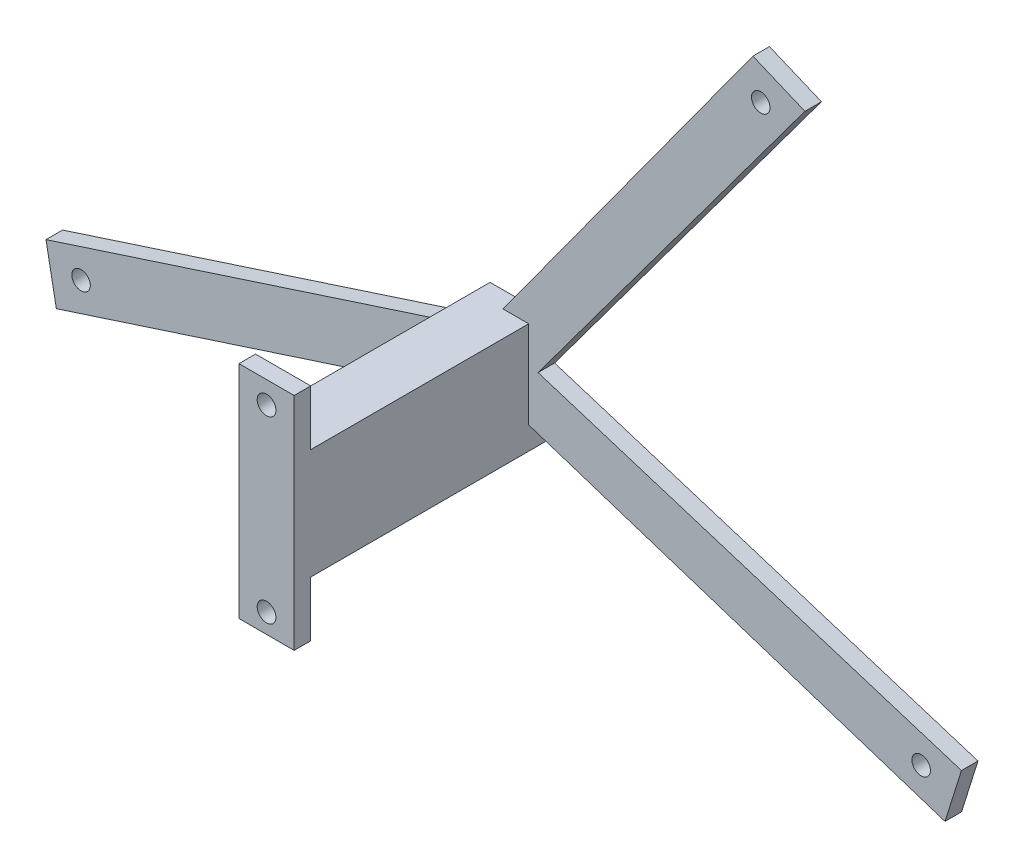
ISO-10303-21;
HEADER;
FILE_DESCRIPTION(('STEP AP214'),'2;1');
FILE_NAME('part.step','',(''),(''),'','','');
FILE_SCHEMA(('AUTOMOTIVE_DESIGN { 1 0 10303 214 1 1 1 1 }'));
ENDSEC;
DATA;
#1=APPLICATION_CONTEXT('core data for automotive mechanical design processes');
#2=APPLICATION_PROTOCOL_DEFINITION('international standard','automotive_design',2000,#1);
#3=PRODUCT_CONTEXT('',#1,'mechanical');
#4=PRODUCT('Part','Part','',(#3));
#5=PRODUCT_RELATED_PRODUCT_CATEGORY('part','',(#4));
#6=PRODUCT_DEFINITION_FORMATION('','',#4);
#7=PRODUCT_DEFINITION_CONTEXT('part definition',#1,'design');
#8=PRODUCT_DEFINITION('design','',#6,#7);
#9=PRODUCT_DEFINITION_SHAPE('','',#8);
#10=(LENGTH_UNIT() NAMED_UNIT(*) SI_UNIT(.MILLI.,.METRE.));
#11=(NAMED_UNIT(*) PLANE_ANGLE_UNIT() SI_UNIT($,.RADIAN.));
#12=(NAMED_UNIT(*) SI_UNIT($,.STERADIAN.) SOLID_ANGLE_UNIT());
#13=UNCERTAINTY_MEASURE_WITH_UNIT(LENGTH_MEASURE(1.E-05),#10,'distance_accuracy_value','');
#14=(GEOMETRIC_REPRESENTATION_CONTEXT(3) GLOBAL_UNCERTAINTY_ASSIGNED_CONTEXT((#13)) GLOBAL_UNIT_ASSIGNED_CONTEXT((#10,
#11,#12)) REPRESENTATION_CONTEXT('',''));
#15=CARTESIAN_POINT('',(0.,0.,0.));
#16=DIRECTION('',(0.,0.,1.));
#17=DIRECTION('',(1.,0.,0.));
#18=AXIS2_PLACEMENT_3D('',#15,#16,#17);
#19=CARTESIAN_POINT('',(0.,0.,8.));
#20=DIRECTION('',(0.,0.,-1.));
#21=DIRECTION('',(-1.,0.,0.));
#22=AXIS2_PLACEMENT_3D('',#19,#20,#21);
#23=PLANE('',#22);
#24=CARTESIAN_POINT('',(47.0395598085176,21.2443996673648,8.));
#25=DIRECTION('',(0.,0.,-1.));
#26=DIRECTION('',(-1.,0.,0.));
#27=AXIS2_PLACEMENT_3D('',#24,#25,#26);
#28=CIRCLE('',#27,1.675);
#29=CARTESIAN_POINT('',(45.3645598085176,21.2443996673648,8.));
#30=VERTEX_POINT('',#29);
#31=EDGE_CURVE('E285',#30,#30,#28,.T.);
#32=ORIENTED_EDGE('',*,*,#31,.T.);
#33=EDGE_LOOP('',(#32));
#34=FACE_BOUND('',#33,.T.);
#35=DIRECTION('',(-0.951056516295152,0.309016994374953,0.));
#36=VECTOR('',#35,1.);
#37=CARTESIAN_POINT('',(86.4547280678285,-76.8481551028898,8.));
#38=LINE('',#37,#36);
#39=CARTESIAN_POINT('',(80.4282405485893,-74.8900306087872,8.));
#40=VERTEX_POINT('',#39);
#41=CARTESIAN_POINT('',(5.,-50.3819096023564,8.));
#42=VERTEX_POINT('',#41);
#43=EDGE_CURVE('E223',#40,#42,#38,.T.);
#44=ORIENTED_EDGE('',*,*,#43,.F.);
#45=DIRECTION('',(0.299533418949089,0.954085808998682,0.));
#46=VECTOR('',#45,1.);
#47=CARTESIAN_POINT('',(94.6143138745912,-29.7039832781096,8.));
#48=LINE('',#47,#46);
#49=CARTESIAN_POINT('',(83.4045304167015,-65.4098332518603,8.));
#50=VERTEX_POINT('',#49);
#51=EDGE_CURVE('E70',#40,#50,#48,.T.);
#52=ORIENTED_EDGE('',*,*,#51,.T.);
#53=DIRECTION('',(0.954085808998682,-0.299533418949089,0.));
#54=VECTOR('',#53,1.);
#55=CARTESIAN_POINT('',(6.69130606358854,-41.3258628664165,8.));
#56=LINE('',#55,#54);
#57=CARTESIAN_POINT('',(6.69130606358854,-41.3258628664165,8.));
#58=VERTEX_POINT('',#57);
#59=EDGE_CURVE('E196',#58,#50,#56,.T.);
#60=ORIENTED_EDGE('',*,*,#59,.F.);
#61=DIRECTION('',(-0.595838024061852,-0.803104631465955,0.));
#62=VECTOR('',#61,1.);
#63=CARTESIAN_POINT('',(58.2556248583607,28.175480737277,8.));
#64=LINE('',#63,#62);
#65=CARTESIAN_POINT('',(55.0430430043356,23.8453788274612,8.));
#66=VERTEX_POINT('',#65);
#67=EDGE_CURVE('E222',#66,#58,#64,.T.);
#68=ORIENTED_EDGE('',*,*,#67,.F.);
#69=DIRECTION('',(-0.922272379336899,0.386540629575024,0.));
#70=VECTOR('',#69,1.);
#71=CARTESIAN_POINT('',(16.724958537207,39.9051642291254,8.));
#72=LINE('',#71,#70);
#73=CARTESIAN_POINT('',(45.6187140872192,27.7952813883114,8.));
#74=VERTEX_POINT('',#73);
#75=EDGE_CURVE('E200',#66,#74,#72,.T.);
#76=ORIENTED_EDGE('',*,*,#75,.T.);
#77=DIRECTION('',(0.587785252292486,0.809016994374938,0.));
#78=VECTOR('',#77,1.);
#79=CARTESIAN_POINT('',(-3.09016994375058,-39.2467459582402,8.));
#80=LINE('',#79,#78);
#81=CARTESIAN_POINT('',(0.348197207266024,-34.5142395756391,8.));
#82=VERTEX_POINT('',#81);
#83=EDGE_CURVE('E206',#82,#74,#80,.T.);
#84=ORIENTED_EDGE('',*,*,#83,.F.);
#85=DIRECTION('',(1.,0.,0.));
#86=VECTOR('',#85,1.);
#87=CARTESIAN_POINT('',(0.,-34.5142395756391,8.));
#88=LINE('',#87,#86);
#89=CARTESIAN_POINT('',(5.,-34.5142395756391,7.99999999999999));
#90=VERTEX_POINT('',#89);
#91=EDGE_CURVE('E263',#82,#90,#88,.T.);
#92=ORIENTED_EDGE('',*,*,#91,.T.);
#93=DIRECTION('',(0.,-1.,0.));
#94=VECTOR('',#93,1.);
#95=CARTESIAN_POINT('',(5.,0.,8.));
#96=LINE('',#95,#94);
#97=EDGE_CURVE('E261',#90,#42,#96,.T.);
#98=ORIENTED_EDGE('',*,*,#97,.T.);
#99=EDGE_LOOP('',(#44,#52,#60,#68,#76,#84,#92,#98));
#100=FACE_BOUND('',#99,.T.);
#101=CARTESIAN_POINT('',(76.1116065860137,-68.230160091727,8.));
#102=DIRECTION('',(0.,0.,-1.));
#103=DIRECTION('',(-1.,0.,0.));
#104=AXIS2_PLACEMENT_3D('',#101,#102,#103);
#105=CIRCLE('',#104,1.675);
#106=CARTESIAN_POINT('',(74.4366065860137,-68.230160091727,8.));
#107=VERTEX_POINT('',#106);
#108=EDGE_CURVE('E275',#107,#107,#105,.T.);
#109=ORIENTED_EDGE('',*,*,#108,.T.);
#110=EDGE_LOOP('',(#109));
#111=FACE_BOUND('',#110,.T.);
#112=ADVANCED_FACE('F55',(#34,#100,#111),#23,.F.);
#113=CARTESIAN_POINT('',(0.,0.,5.));
#114=DIRECTION('',(0.,0.,-1.));
#115=DIRECTION('',(-1.,0.,0.));
#116=AXIS2_PLACEMENT_3D('',#113,#114,#115);
#117=PLANE('',#116);
#118=DIRECTION('',(0.299533418949089,0.954085808998682,0.));
#119=VECTOR('',#118,1.);
#120=CARTESIAN_POINT('',(83.4045304167015,-65.4098332518603,5.));
#121=LINE('',#120,#119);
#122=CARTESIAN_POINT('',(80.4282405485893,-74.8900306087872,5.));
#123=VERTEX_POINT('',#122);
#124=CARTESIAN_POINT('',(83.4045304167015,-65.4098332518603,5.));
#125=VERTEX_POINT('',#124);
#126=EDGE_CURVE('E176',#123,#125,#121,.T.);
#127=ORIENTED_EDGE('',*,*,#126,.F.);
#128=DIRECTION('',(-0.951056516295152,0.309016994374953,0.));
#129=VECTOR('',#128,1.);
#130=CARTESIAN_POINT('',(86.4547280678285,-76.8481551028898,5.));
#131=LINE('',#130,#129);
#132=CARTESIAN_POINT('',(5.,-50.3819096023564,5.));
#133=VERTEX_POINT('',#132);
#134=EDGE_CURVE('E204',#123,#133,#131,.T.);
#135=ORIENTED_EDGE('',*,*,#134,.T.);
#136=DIRECTION('',(0.,-1.,0.));
#137=VECTOR('',#136,1.);
#138=CARTESIAN_POINT('',(5.,-34.5142395756391,5.));
#139=LINE('',#138,#137);
#140=CARTESIAN_POINT('',(5.,-54.5142395756391,5.));
#141=VERTEX_POINT('',#140);
#142=EDGE_CURVE('E379',#133,#141,#139,.T.);
#143=ORIENTED_EDGE('',*,*,#142,.T.);
#144=DIRECTION('',(-1.,0.,0.));
#145=VECTOR('',#144,1.);
#146=CARTESIAN_POINT('',(5.,-54.5142395756391,5.));
#147=LINE('',#146,#145);
#148=CARTESIAN_POINT('',(-5.,-54.5142395756391,5.));
#149=VERTEX_POINT('',#148);
#150=EDGE_CURVE('E383',#141,#149,#147,.T.);
#151=ORIENTED_EDGE('',*,*,#150,.T.);
#152=DIRECTION('',(0.,1.,0.));
#153=VECTOR('',#152,1.);
#154=CARTESIAN_POINT('',(-5.,-34.5142395756391,5.));
#155=LINE('',#154,#153);
#156=CARTESIAN_POINT('',(-5.,-50.3819096023567,5.));
#157=VERTEX_POINT('',#156);
#158=EDGE_CURVE('E389',#149,#157,#155,.T.);
#159=ORIENTED_EDGE('',*,*,#158,.T.);
#160=DIRECTION('',(-0.951056516295154,-0.309016994374944,0.));
#161=VECTOR('',#160,1.);
#162=CARTESIAN_POINT('',(-86.1694111129402,-76.7554500045769,5.));
#163=LINE('',#162,#161);
#164=CARTESIAN_POINT('',(-80.5822705593196,-74.9400779930839,5.));
#165=VERTEX_POINT('',#164);
#166=EDGE_CURVE('E210',#157,#165,#163,.T.);
#167=ORIENTED_EDGE('',*,*,#166,.T.);
#168=DIRECTION('',(0.186226776729701,-0.982506787573942,0.));
#169=VECTOR('',#168,1.);
#170=CARTESIAN_POINT('',(-83.6117022391609,-58.9572143028869,5.));
#171=LINE('',#170,#169);
#172=CARTESIAN_POINT('',(-82.4596195943629,-65.0354434288898,5.));
#173=VERTEX_POINT('',#172);
#174=EDGE_CURVE('E653',#173,#165,#171,.T.);
#175=ORIENTED_EDGE('',*,*,#174,.F.);
#176=DIRECTION('',(0.951056516295155,0.309016994374944,0.));
#177=VECTOR('',#176,1.);
#178=CARTESIAN_POINT('',(-3.09016994375058,-39.2467459582402,5.));
#179=LINE('',#178,#177);
#180=CARTESIAN_POINT('',(-5.,-39.8672873599732,5.));
#181=VERTEX_POINT('',#180);
#182=EDGE_CURVE('E212',#173,#181,#179,.T.);
#183=ORIENTED_EDGE('',*,*,#182,.T.);
#184=CARTESIAN_POINT('',(-5.,-34.5142395756391,5.));
#185=VERTEX_POINT('',#184);
#186=EDGE_CURVE('E386',#181,#185,#155,.T.);
#187=ORIENTED_EDGE('',*,*,#186,.T.);
#188=DIRECTION('',(1.,0.,0.));
#189=VECTOR('',#188,1.);
#190=CARTESIAN_POINT('',(5.,-34.5142395756391,5.));
#191=LINE('',#190,#189);
#192=CARTESIAN_POINT('',(0.348197207266024,-34.5142395756391,5.));
#193=VERTEX_POINT('',#192);
#194=EDGE_CURVE('E395',#185,#193,#191,.T.);
#195=ORIENTED_EDGE('',*,*,#194,.T.);
#196=DIRECTION('',(0.587785252292486,0.809016994374938,0.));
#197=VECTOR('',#196,1.);
#198=CARTESIAN_POINT('',(-3.09016994375058,-39.2467459582402,5.));
#199=LINE('',#198,#197);
#200=CARTESIAN_POINT('',(45.6187140872192,27.7952813883114,5.));
#201=VERTEX_POINT('',#200);
#202=EDGE_CURVE('E220',#193,#201,#199,.T.);
#203=ORIENTED_EDGE('',*,*,#202,.T.);
#204=DIRECTION('',(-0.922272379336899,0.386540629575024,0.));
#205=VECTOR('',#204,1.);
#206=CARTESIAN_POINT('',(60.4213801121897,21.5912228337282,5.));
#207=LINE('',#206,#205);
#208=CARTESIAN_POINT('',(55.0430430043356,23.8453788274612,5.));
#209=VERTEX_POINT('',#208);
#210=EDGE_CURVE('E190',#209,#201,#207,.T.);
#211=ORIENTED_EDGE('',*,*,#210,.F.);
#212=DIRECTION('',(-0.595838024061852,-0.803104631465955,0.));
#213=VECTOR('',#212,1.);
#214=CARTESIAN_POINT('',(58.2556248583607,28.175480737277,5.));
#215=LINE('',#214,#213);
#216=CARTESIAN_POINT('',(6.69130606358854,-41.3258628664165,5.));
#217=VERTEX_POINT('',#216);
#218=EDGE_CURVE('E202',#209,#217,#215,.T.);
#219=ORIENTED_EDGE('',*,*,#218,.T.);
#220=DIRECTION('',(0.954085808998682,-0.299533418949089,0.));
#221=VECTOR('',#220,1.);
#222=CARTESIAN_POINT('',(6.69130606358854,-41.3258628664165,5.));
#223=LINE('',#222,#221);
#224=EDGE_CURVE('E192',#217,#125,#223,.T.);
#225=ORIENTED_EDGE('',*,*,#224,.T.);
#226=EDGE_LOOP('',(#127,#135,#143,#151,#159,#167,#175,#183,#187,#195,#203,#211,#219,#225));
#227=FACE_BOUND('',#226,.T.);
#228=CARTESIAN_POINT('',(47.0395598085176,21.2443996673648,5.));
#229=DIRECTION('',(0.,0.,-1.));
#230=DIRECTION('',(-1.,0.,0.));
#231=AXIS2_PLACEMENT_3D('',#228,#229,#230);
#232=CIRCLE('',#231,1.675);
#233=CARTESIAN_POINT('',(45.3645598085176,21.2443996673648,5.));
#234=VERTEX_POINT('',#233);
#235=EDGE_CURVE('E225',#234,#234,#232,.T.);
#236=ORIENTED_EDGE('',*,*,#235,.F.);
#237=EDGE_LOOP('',(#236));
#238=FACE_BOUND('',#237,.T.);
#239=CARTESIAN_POINT('',(76.1116065860137,-68.230160091727,5.));
#240=DIRECTION('',(0.,0.,-1.));
#241=DIRECTION('',(-1.,0.,0.));
#242=AXIS2_PLACEMENT_3D('',#239,#240,#241);
#243=CIRCLE('',#242,1.675);
#244=CARTESIAN_POINT('',(74.4366065860137,-68.230160091727,5.));
#245=VERTEX_POINT('',#244);
#246=EDGE_CURVE('E273',#245,#245,#243,.T.);
#247=ORIENTED_EDGE('',*,*,#246,.F.);
#248=EDGE_LOOP('',(#247));
#249=FACE_BOUND('',#248,.T.);
#250=CARTESIAN_POINT('',(-76.1116065860141,-68.2301600917259,5.));
#251=DIRECTION('',(0.,0.,-1.));
#252=DIRECTION('',(-1.,0.,0.));
#253=AXIS2_PLACEMENT_3D('',#250,#251,#252);
#254=CIRCLE('',#253,1.675);
#255=CARTESIAN_POINT('',(-77.7866065860141,-68.2301600917259,5.));
#256=VERTEX_POINT('',#255);
#257=EDGE_CURVE('E278',#256,#256,#254,.T.);
#258=ORIENTED_EDGE('',*,*,#257,.F.);
#259=EDGE_LOOP('',(#258));
#260=FACE_BOUND('',#259,.T.);
#261=ADVANCED_FACE('F197',(#227,#238,#249,#260),#117,.T.);
#262=DIRECTION('',(0.951056516295155,0.309016994374944,0.));
#263=VECTOR('',#262,1.);
#264=CARTESIAN_POINT('',(-3.09016994375058,-39.2467459582402,8.));
#265=LINE('',#264,#263);
#266=CARTESIAN_POINT('',(-82.4596195943629,-65.0354434288898,8.));
#267=VERTEX_POINT('',#266);
#268=CARTESIAN_POINT('',(-5.,-39.8672873599732,8.));
#269=VERTEX_POINT('',#268);
#270=EDGE_CURVE('E226',#267,#269,#265,.T.);
#271=ORIENTED_EDGE('',*,*,#270,.F.);
#272=DIRECTION('',(0.186226776729701,-0.982506787573942,0.));
#273=VECTOR('',#272,1.);
#274=CARTESIAN_POINT('',(-91.4993607248835,-17.3430160851086,8.));
#275=LINE('',#274,#273);
#276=CARTESIAN_POINT('',(-80.5822705593196,-74.9400779930839,8.));
#277=VERTEX_POINT('',#276);
#278=EDGE_CURVE('E71',#267,#277,#275,.T.);
#279=ORIENTED_EDGE('',*,*,#278,.T.);
#280=DIRECTION('',(-0.951056516295154,-0.309016994374944,0.));
#281=VECTOR('',#280,1.);
#282=CARTESIAN_POINT('',(-86.1694111129402,-76.7554500045769,8.));
#283=LINE('',#282,#281);
#284=CARTESIAN_POINT('',(-5.,-50.3819096023567,8.));
#285=VERTEX_POINT('',#284);
#286=EDGE_CURVE('E230',#285,#277,#283,.T.);
#287=ORIENTED_EDGE('',*,*,#286,.F.);
#288=DIRECTION('',(0.,1.,0.));
#289=VECTOR('',#288,1.);
#290=CARTESIAN_POINT('',(-4.99999999999999,0.,8.));
#291=LINE('',#290,#289);
#292=EDGE_CURVE('E257',#285,#269,#291,.T.);
#293=ORIENTED_EDGE('',*,*,#292,.T.);
#294=EDGE_LOOP('',(#271,#279,#287,#293));
#295=FACE_BOUND('',#294,.T.);
#296=CARTESIAN_POINT('',(-76.1116065860141,-68.2301600917259,8.));
#297=DIRECTION('',(0.,0.,-1.));
#298=DIRECTION('',(-1.,0.,0.));
#299=AXIS2_PLACEMENT_3D('',#296,#297,#298);
#300=CIRCLE('',#299,1.675);
#301=CARTESIAN_POINT('',(-77.7866065860141,-68.2301600917259,8.));
#302=VERTEX_POINT('',#301);
#303=EDGE_CURVE('E276',#302,#302,#300,.T.);
#304=ORIENTED_EDGE('',*,*,#303,.T.);
#305=EDGE_LOOP('',(#304));
#306=FACE_BOUND('',#305,.T.);
#307=ADVANCED_FACE('F254',(#295,#306),#23,.F.);
#308=CARTESIAN_POINT('',(58.2556248583607,28.175480737277,5.));
#309=DIRECTION('',(-0.803104631465955,0.595838024061852,0.));
#310=DIRECTION('',(-0.595838024061852,-0.803104631465955,0.));
#311=AXIS2_PLACEMENT_3D('',#308,#309,#310);
#312=PLANE('',#311);
#313=ORIENTED_EDGE('',*,*,#218,.F.);
#314=DIRECTION('',(0.,0.,1.));
#315=VECTOR('',#314,1.);
#316=CARTESIAN_POINT('',(55.0430430043356,23.8453788274612,5.));
#317=LINE('',#316,#315);
#318=EDGE_CURVE('E325',#209,#66,#317,.T.);
#319=ORIENTED_EDGE('',*,*,#318,.T.);
#320=ORIENTED_EDGE('',*,*,#67,.T.);
#321=DIRECTION('',(0.,0.,1.));
#322=VECTOR('',#321,1.);
#323=CARTESIAN_POINT('',(6.69130606358854,-41.3258628664165,5.));
#324=LINE('',#323,#322);
#325=EDGE_CURVE('E219',#217,#58,#324,.T.);
#326=ORIENTED_EDGE('',*,*,#325,.F.);
#327=EDGE_LOOP('',(#313,#319,#320,#326));
#328=FACE_BOUND('',#327,.T.);
#329=ADVANCED_FACE('F53',(#328),#312,.F.);
#330=CARTESIAN_POINT('',(6.69130606358854,-41.3258628664165,5.));
#331=DIRECTION('',(-0.299533418949089,-0.954085808998682,0.));
#332=DIRECTION('',(0.954085808998682,-0.299533418949089,0.));
#333=AXIS2_PLACEMENT_3D('',#330,#331,#332);
#334=PLANE('',#333);
#335=ORIENTED_EDGE('',*,*,#59,.T.);
#336=DIRECTION('',(0.,0.,-1.));
#337=VECTOR('',#336,1.);
#338=CARTESIAN_POINT('',(83.4045304167015,-65.4098332518603,50.5));
#339=LINE('',#338,#337);
#340=EDGE_CURVE('E181',#50,#125,#339,.T.);
#341=ORIENTED_EDGE('',*,*,#340,.T.);
#342=ORIENTED_EDGE('',*,*,#224,.F.);
#343=ORIENTED_EDGE('',*,*,#325,.T.);
#344=EDGE_LOOP('',(#335,#341,#342,#343));
#345=FACE_BOUND('',#344,.T.);
#346=ADVANCED_FACE('F195',(#345),#334,.F.);
#347=CARTESIAN_POINT('',(86.4547280678285,-76.8481551028898,5.));
#348=DIRECTION('',(0.309016994374954,0.951056516295152,0.));
#349=DIRECTION('',(-0.951056516295152,0.309016994374954,0.));
#350=AXIS2_PLACEMENT_3D('',#347,#348,#349);
#351=PLANE('',#350);
#352=ORIENTED_EDGE('',*,*,#134,.F.);
#353=DIRECTION('',(0.,0.,1.));
#354=VECTOR('',#353,1.);
#355=CARTESIAN_POINT('',(80.4282405485893,-74.8900306087872,5.));
#356=LINE('',#355,#354);
#357=EDGE_CURVE('E13',#123,#40,#356,.T.);
#358=ORIENTED_EDGE('',*,*,#357,.T.);
#359=ORIENTED_EDGE('',*,*,#43,.T.);
#360=DIRECTION('',(0.,0.,-1.));
#361=VECTOR('',#360,1.);
#362=CARTESIAN_POINT('',(5.,-50.3819096023564,5.));
#363=LINE('',#362,#361);
#364=EDGE_CURVE('E241',#42,#133,#363,.T.);
#365=ORIENTED_EDGE('',*,*,#364,.T.);
#366=EDGE_LOOP('',(#352,#358,#359,#365));
#367=FACE_BOUND('',#366,.T.);
#368=ADVANCED_FACE('F322',(#367),#351,.F.);
#369=CARTESIAN_POINT('',(-86.1694111129402,-76.7554500045769,5.));
#370=DIRECTION('',(-0.309016994374945,0.951056516295155,0.));
#371=DIRECTION('',(-0.951056516295155,-0.309016994374945,0.));
#372=AXIS2_PLACEMENT_3D('',#369,#370,#371);
#373=PLANE('',#372);
#374=ORIENTED_EDGE('',*,*,#286,.T.);
#375=DIRECTION('',(0.,0.,-1.));
#376=VECTOR('',#375,1.);
#377=CARTESIAN_POINT('',(-80.5822705593196,-74.9400779930839,5.));
#378=LINE('',#377,#376);
#379=EDGE_CURVE('E329',#277,#165,#378,.T.);
#380=ORIENTED_EDGE('',*,*,#379,.T.);
#381=ORIENTED_EDGE('',*,*,#166,.F.);
#382=DIRECTION('',(0.,0.,1.));
#383=VECTOR('',#382,1.);
#384=CARTESIAN_POINT('',(-5.,-50.3819096023567,5.));
#385=LINE('',#384,#383);
#386=EDGE_CURVE('E259',#157,#285,#385,.T.);
#387=ORIENTED_EDGE('',*,*,#386,.T.);
#388=EDGE_LOOP('',(#374,#380,#381,#387));
#389=FACE_BOUND('',#388,.T.);
#390=ADVANCED_FACE('F429',(#389),#373,.F.);
#391=CARTESIAN_POINT('',(-3.09016994375058,-39.2467459582402,5.));
#392=DIRECTION('',(0.309016994374944,-0.951056516295155,0.));
#393=DIRECTION('',(0.951056516295155,0.309016994374944,0.));
#394=AXIS2_PLACEMENT_3D('',#391,#392,#393);
#395=PLANE('',#394);
#396=ORIENTED_EDGE('',*,*,#182,.F.);
#397=DIRECTION('',(0.,0.,1.));
#398=VECTOR('',#397,1.);
#399=CARTESIAN_POINT('',(-82.4596195943629,-65.0354434288898,5.));
#400=LINE('',#399,#398);
#401=EDGE_CURVE('E58',#173,#267,#400,.T.);
#402=ORIENTED_EDGE('',*,*,#401,.T.);
#403=ORIENTED_EDGE('',*,*,#270,.T.);
#404=DIRECTION('',(0.,0.,-1.));
#405=VECTOR('',#404,1.);
#406=CARTESIAN_POINT('',(-5.,-39.8672873599732,5.));
#407=LINE('',#406,#405);
#408=EDGE_CURVE('E236',#269,#181,#407,.T.);
#409=ORIENTED_EDGE('',*,*,#408,.T.);
#410=EDGE_LOOP('',(#396,#402,#403,#409));
#411=FACE_BOUND('',#410,.T.);
#412=ADVANCED_FACE('F246',(#411),#395,.F.);
#413=CARTESIAN_POINT('',(-3.09016994375058,-39.2467459582402,5.));
#414=DIRECTION('',(0.809016994374938,-0.587785252292486,0.));
#415=DIRECTION('',(0.587785252292486,0.809016994374938,0.));
#416=AXIS2_PLACEMENT_3D('',#413,#414,#415);
#417=PLANE('',#416);
#418=ORIENTED_EDGE('',*,*,#83,.T.);
#419=DIRECTION('',(0.,0.,-1.));
#420=VECTOR('',#419,1.);
#421=CARTESIAN_POINT('',(45.6187140872192,27.7952813883114,5.));
#422=LINE('',#421,#420);
#423=EDGE_CURVE('E242',#74,#201,#422,.T.);
#424=ORIENTED_EDGE('',*,*,#423,.T.);
#425=ORIENTED_EDGE('',*,*,#202,.F.);
#426=DIRECTION('',(0.,0.,1.));
#427=VECTOR('',#426,1.);
#428=CARTESIAN_POINT('',(0.348197207266024,-34.5142395756391,5.));
#429=LINE('',#428,#427);
#430=EDGE_CURVE('E233',#193,#82,#429,.T.);
#431=ORIENTED_EDGE('',*,*,#430,.T.);
#432=EDGE_LOOP('',(#418,#424,#425,#431));
#433=FACE_BOUND('',#432,.T.);
#434=ADVANCED_FACE('F292',(#433),#417,.F.);
#435=CARTESIAN_POINT('',(47.0395598085176,21.2443996673648,5.));
#436=DIRECTION('',(0.,0.,1.));
#437=DIRECTION('',(1.,0.,0.));
#438=AXIS2_PLACEMENT_3D('',#435,#436,#437);
#439=CYLINDRICAL_SURFACE('',#438,1.675);
#440=ORIENTED_EDGE('',*,*,#235,.T.);
#441=EDGE_LOOP('',(#440));
#442=FACE_BOUND('',#441,.T.);
#443=ORIENTED_EDGE('',*,*,#31,.F.);
#444=EDGE_LOOP('',(#443));
#445=FACE_BOUND('',#444,.T.);
#446=ADVANCED_FACE('F291',(#442,#445),#439,.F.);
#447=CARTESIAN_POINT('',(-76.1116065860141,-68.2301600917259,5.));
#448=DIRECTION('',(0.,0.,1.));
#449=DIRECTION('',(1.,0.,0.));
#450=AXIS2_PLACEMENT_3D('',#447,#448,#449);
#451=CYLINDRICAL_SURFACE('',#450,1.675);
#452=ORIENTED_EDGE('',*,*,#257,.T.);
#453=EDGE_LOOP('',(#452));
#454=FACE_BOUND('',#453,.T.);
#455=ORIENTED_EDGE('',*,*,#303,.F.);
#456=EDGE_LOOP('',(#455));
#457=FACE_BOUND('',#456,.T.);
#458=ADVANCED_FACE('F293',(#454,#457),#451,.F.);
#459=CARTESIAN_POINT('',(76.1116065860137,-68.230160091727,5.));
#460=DIRECTION('',(0.,0.,1.));
#461=DIRECTION('',(1.,0.,0.));
#462=AXIS2_PLACEMENT_3D('',#459,#460,#461);
#463=CYLINDRICAL_SURFACE('',#462,1.675);
#464=ORIENTED_EDGE('',*,*,#246,.T.);
#465=EDGE_LOOP('',(#464));
#466=FACE_BOUND('',#465,.T.);
#467=ORIENTED_EDGE('',*,*,#108,.F.);
#468=EDGE_LOOP('',(#467));
#469=FACE_BOUND('',#468,.T.);
#470=ADVANCED_FACE('F298',(#466,#469),#463,.F.);
#471=CARTESIAN_POINT('',(5.,-34.5142395756391,79.8606797749979));
#472=DIRECTION('',(1.,0.,0.));
#473=DIRECTION('',(0.,1.,0.));
#474=AXIS2_PLACEMENT_3D('',#471,#472,#473);
#475=PLANE('',#474);
#476=ORIENTED_EDGE('',*,*,#97,.F.);
#477=DIRECTION('',(0.,0.,-1.));
#478=VECTOR('',#477,1.);
#479=CARTESIAN_POINT('',(5.,-34.5142395756391,79.8606797749979));
#480=LINE('',#479,#478);
#481=CARTESIAN_POINT('',(5.,-34.5142395756391,47.5));
#482=VERTEX_POINT('',#481);
#483=EDGE_CURVE('E381',#482,#90,#480,.T.);
#484=ORIENTED_EDGE('',*,*,#483,.F.);
#485=DIRECTION('',(0.,1.,0.));
#486=VECTOR('',#485,1.);
#487=CARTESIAN_POINT('',(5.,-24.5142395756391,47.5));
#488=LINE('',#487,#486);
#489=CARTESIAN_POINT('',(5.,-24.5142395756391,47.5));
#490=VERTEX_POINT('',#489);
#491=EDGE_CURVE('E361',#482,#490,#488,.T.);
#492=ORIENTED_EDGE('',*,*,#491,.T.);
#493=DIRECTION('',(0.,0.,-1.));
#494=VECTOR('',#493,1.);
#495=CARTESIAN_POINT('',(5.,-24.5142395756391,50.5));
#496=LINE('',#495,#494);
#497=CARTESIAN_POINT('',(5.,-24.5142395756391,50.5));
#498=VERTEX_POINT('',#497);
#499=EDGE_CURVE('E369',#498,#490,#496,.T.);
#500=ORIENTED_EDGE('',*,*,#499,.F.);
#501=DIRECTION('',(0.,1.,0.));
#502=VECTOR('',#501,1.);
#503=CARTESIAN_POINT('',(5.,-24.5142395756391,50.5));
#504=LINE('',#503,#502);
#505=CARTESIAN_POINT('',(5.,-64.5142395756392,50.5));
#506=VERTEX_POINT('',#505);
#507=EDGE_CURVE('E352',#506,#498,#504,.T.);
#508=ORIENTED_EDGE('',*,*,#507,.F.);
#509=DIRECTION('',(0.,0.,-1.));
#510=VECTOR('',#509,1.);
#511=CARTESIAN_POINT('',(5.,-64.5142395756392,50.5));
#512=LINE('',#511,#510);
#513=CARTESIAN_POINT('',(5.,-64.5142395756392,47.5));
#514=VERTEX_POINT('',#513);
#515=EDGE_CURVE('E375',#506,#514,#512,.T.);
#516=ORIENTED_EDGE('',*,*,#515,.T.);
#517=CARTESIAN_POINT('',(5.,-54.5142395756391,47.5));
#518=VERTEX_POINT('',#517);
#519=EDGE_CURVE('E364',#514,#518,#488,.T.);
#520=ORIENTED_EDGE('',*,*,#519,.T.);
#521=DIRECTION('',(0.,0.,-1.));
#522=VECTOR('',#521,1.);
#523=CARTESIAN_POINT('',(5.,-54.5142395756391,79.8606797749979));
#524=LINE('',#523,#522);
#525=EDGE_CURVE('E394',#518,#141,#524,.T.);
#526=ORIENTED_EDGE('',*,*,#525,.T.);
#527=ORIENTED_EDGE('',*,*,#142,.F.);
#528=ORIENTED_EDGE('',*,*,#364,.F.);
#529=EDGE_LOOP('',(#476,#484,#492,#500,#508,#516,#520,#526,#527,#528));
#530=FACE_BOUND('',#529,.T.);
#531=ADVANCED_FACE('F411',(#530),#475,.T.);
#532=CARTESIAN_POINT('',(-5.,-34.5142395756391,79.8606797749979));
#533=DIRECTION('',(-1.,0.,0.));
#534=DIRECTION('',(0.,-1.,0.));
#535=AXIS2_PLACEMENT_3D('',#532,#533,#534);
#536=PLANE('',#535);
#537=ORIENTED_EDGE('',*,*,#386,.F.);
#538=ORIENTED_EDGE('',*,*,#158,.F.);
#539=DIRECTION('',(0.,0.,-1.));
#540=VECTOR('',#539,1.);
#541=CARTESIAN_POINT('',(-5.,-54.5142395756391,79.8606797749979));
#542=LINE('',#541,#540);
#543=CARTESIAN_POINT('',(-5.,-54.5142395756391,47.5));
#544=VERTEX_POINT('',#543);
#545=EDGE_CURVE('E402',#544,#149,#542,.T.);
#546=ORIENTED_EDGE('',*,*,#545,.F.);
#547=DIRECTION('',(0.,-1.,0.));
#548=VECTOR('',#547,1.);
#549=CARTESIAN_POINT('',(-4.99999999999999,-24.5142395756391,47.5));
#550=LINE('',#549,#548);
#551=CARTESIAN_POINT('',(-4.99999999999999,-64.5142395756392,47.5));
#552=VERTEX_POINT('',#551);
#553=EDGE_CURVE('E342',#544,#552,#550,.T.);
#554=ORIENTED_EDGE('',*,*,#553,.T.);
#555=DIRECTION('',(0.,0.,-1.));
#556=VECTOR('',#555,1.);
#557=CARTESIAN_POINT('',(-4.99999999999999,-64.5142395756392,50.5));
#558=LINE('',#557,#556);
#559=CARTESIAN_POINT('',(-4.99999999999999,-64.5142395756392,50.5));
#560=VERTEX_POINT('',#559);
#561=EDGE_CURVE('E377',#560,#552,#558,.T.);
#562=ORIENTED_EDGE('',*,*,#561,.F.);
#563=DIRECTION('',(0.,-1.,0.));
#564=VECTOR('',#563,1.);
#565=CARTESIAN_POINT('',(-4.99999999999999,-24.5142395756391,50.5));
#566=LINE('',#565,#564);
#567=CARTESIAN_POINT('',(-4.99999999999999,-24.5142395756391,50.5));
#568=VERTEX_POINT('',#567);
#569=EDGE_CURVE('E350',#568,#560,#566,.T.);
#570=ORIENTED_EDGE('',*,*,#569,.F.);
#571=DIRECTION('',(0.,0.,-1.));
#572=VECTOR('',#571,1.);
#573=CARTESIAN_POINT('',(-4.99999999999999,-24.5142395756391,50.5));
#574=LINE('',#573,#572);
#575=CARTESIAN_POINT('',(-4.99999999999999,-24.5142395756391,47.5));
#576=VERTEX_POINT('',#575);
#577=EDGE_CURVE('E360',#568,#576,#574,.T.);
#578=ORIENTED_EDGE('',*,*,#577,.T.);
#579=CARTESIAN_POINT('',(-5.,-34.5142395756391,47.5));
#580=VERTEX_POINT('',#579);
#581=EDGE_CURVE('E359',#576,#580,#550,.T.);
#582=ORIENTED_EDGE('',*,*,#581,.T.);
#583=DIRECTION('',(0.,0.,-1.));
#584=VECTOR('',#583,1.);
#585=CARTESIAN_POINT('',(-5.,-34.5142395756391,79.8606797749979));
#586=LINE('',#585,#584);
#587=EDGE_CURVE('E400',#580,#185,#586,.T.);
#588=ORIENTED_EDGE('',*,*,#587,.T.);
#589=ORIENTED_EDGE('',*,*,#186,.F.);
#590=ORIENTED_EDGE('',*,*,#408,.F.);
#591=ORIENTED_EDGE('',*,*,#292,.F.);
#592=EDGE_LOOP('',(#537,#538,#546,#554,#562,#570,#578,#582,#588,#589,#590,#591));
#593=FACE_BOUND('',#592,.T.);
#594=ADVANCED_FACE('F423',(#593),#536,.T.);
#595=CARTESIAN_POINT('',(5.,-34.5142395756391,79.8606797749979));
#596=DIRECTION('',(0.,1.,0.));
#597=DIRECTION('',(0.,0.,1.));
#598=AXIS2_PLACEMENT_3D('',#595,#596,#597);
#599=PLANE('',#598);
#600=ORIENTED_EDGE('',*,*,#91,.F.);
#601=ORIENTED_EDGE('',*,*,#430,.F.);
#602=ORIENTED_EDGE('',*,*,#194,.F.);
#603=ORIENTED_EDGE('',*,*,#587,.F.);
#604=DIRECTION('',(-1.,0.,0.));
#605=VECTOR('',#604,1.);
#606=CARTESIAN_POINT('',(5.,-34.5142395756391,47.5));
#607=LINE('',#606,#605);
#608=EDGE_CURVE('E376',#482,#580,#607,.T.);
#609=ORIENTED_EDGE('',*,*,#608,.F.);
#610=ORIENTED_EDGE('',*,*,#483,.T.);
#611=EDGE_LOOP('',(#600,#601,#602,#603,#609,#610));
#612=FACE_BOUND('',#611,.T.);
#613=ADVANCED_FACE('F547',(#612),#599,.T.);
#614=CARTESIAN_POINT('',(5.,-54.5142395756391,79.8606797749979));
#615=DIRECTION('',(0.,-1.,0.));
#616=DIRECTION('',(0.,0.,-1.));
#617=AXIS2_PLACEMENT_3D('',#614,#615,#616);
#618=PLANE('',#617);
#619=DIRECTION('',(1.,0.,0.));
#620=VECTOR('',#619,1.);
#621=CARTESIAN_POINT('',(5.,-54.5142395756391,47.5));
#622=LINE('',#621,#620);
#623=EDGE_CURVE('E266',#544,#518,#622,.T.);
#624=ORIENTED_EDGE('',*,*,#623,.F.);
#625=ORIENTED_EDGE('',*,*,#545,.T.);
#626=ORIENTED_EDGE('',*,*,#150,.F.);
#627=ORIENTED_EDGE('',*,*,#525,.F.);
#628=EDGE_LOOP('',(#624,#625,#626,#627));
#629=FACE_BOUND('',#628,.T.);
#630=ADVANCED_FACE('F424',(#629),#618,.T.);
#631=CARTESIAN_POINT('',(0.,0.,47.5));
#632=DIRECTION('',(0.,0.,1.));
#633=DIRECTION('',(1.,0.,0.));
#634=AXIS2_PLACEMENT_3D('',#631,#632,#633);
#635=PLANE('',#634);
#636=CARTESIAN_POINT('',(0.,-28.5000395756391,47.5));
#637=DIRECTION('',(0.,0.,1.));
#638=DIRECTION('',(1.,0.,0.));
#639=AXIS2_PLACEMENT_3D('',#636,#637,#638);
#640=CIRCLE('',#639,1.7);
#641=CARTESIAN_POINT('',(1.7,-28.5000395756391,47.5));
#642=VERTEX_POINT('',#641);
#643=EDGE_CURVE('E339',#642,#642,#640,.T.);
#644=ORIENTED_EDGE('',*,*,#643,.T.);
#645=EDGE_LOOP('',(#644));
#646=FACE_BOUND('',#645,.T.);
#647=ORIENTED_EDGE('',*,*,#491,.F.);
#648=ORIENTED_EDGE('',*,*,#608,.T.);
#649=ORIENTED_EDGE('',*,*,#581,.F.);
#650=DIRECTION('',(-1.,0.,0.));
#651=VECTOR('',#650,1.);
#652=CARTESIAN_POINT('',(-4.99999999999999,-24.5142395756391,47.5));
#653=LINE('',#652,#651);
#654=EDGE_CURVE('E351',#490,#576,#653,.T.);
#655=ORIENTED_EDGE('',*,*,#654,.F.);
#656=EDGE_LOOP('',(#647,#648,#649,#655));
#657=FACE_BOUND('',#656,.T.);
#658=ADVANCED_FACE('F529',(#646,#657),#635,.F.);
#659=CARTESIAN_POINT('',(0.,-61.0000395756391,47.5));
#660=DIRECTION('',(0.,0.,1.));
#661=DIRECTION('',(1.,0.,0.));
#662=AXIS2_PLACEMENT_3D('',#659,#660,#661);
#663=CIRCLE('',#662,1.7);
#664=CARTESIAN_POINT('',(1.70000000000001,-61.0000395756391,47.5));
#665=VERTEX_POINT('',#664);
#666=EDGE_CURVE('E328',#665,#665,#663,.T.);
#667=ORIENTED_EDGE('',*,*,#666,.T.);
#668=EDGE_LOOP('',(#667));
#669=FACE_BOUND('',#668,.T.);
#670=ORIENTED_EDGE('',*,*,#553,.F.);
#671=ORIENTED_EDGE('',*,*,#623,.T.);
#672=ORIENTED_EDGE('',*,*,#519,.F.);
#673=DIRECTION('',(1.,0.,0.));
#674=VECTOR('',#673,1.);
#675=CARTESIAN_POINT('',(-4.99999999999999,-64.5142395756392,47.5));
#676=LINE('',#675,#674);
#677=EDGE_CURVE('E363',#552,#514,#676,.T.);
#678=ORIENTED_EDGE('',*,*,#677,.F.);
#679=EDGE_LOOP('',(#670,#671,#672,#678));
#680=FACE_BOUND('',#679,.T.);
#681=ADVANCED_FACE('F410',(#669,#680),#635,.F.);
#682=CARTESIAN_POINT('',(0.,0.,50.5));
#683=DIRECTION('',(0.,0.,1.));
#684=DIRECTION('',(1.,0.,0.));
#685=AXIS2_PLACEMENT_3D('',#682,#683,#684);
#686=PLANE('',#685);
#687=CARTESIAN_POINT('',(0.,-28.5000395756391,50.5));
#688=DIRECTION('',(0.,0.,1.));
#689=DIRECTION('',(1.,0.,0.));
#690=AXIS2_PLACEMENT_3D('',#687,#688,#689);
#691=CIRCLE('',#690,1.7);
#692=CARTESIAN_POINT('',(1.7,-28.5000395756391,50.5));
#693=VERTEX_POINT('',#692);
#694=EDGE_CURVE('E341',#693,#693,#691,.T.);
#695=ORIENTED_EDGE('',*,*,#694,.F.);
#696=EDGE_LOOP('',(#695));
#697=FACE_BOUND('',#696,.T.);
#698=ORIENTED_EDGE('',*,*,#569,.T.);
#699=DIRECTION('',(1.,0.,0.));
#700=VECTOR('',#699,1.);
#701=CARTESIAN_POINT('',(-4.99999999999999,-64.5142395756392,50.5));
#702=LINE('',#701,#700);
#703=EDGE_CURVE('E349',#560,#506,#702,.T.);
#704=ORIENTED_EDGE('',*,*,#703,.T.);
#705=ORIENTED_EDGE('',*,*,#507,.T.);
#706=DIRECTION('',(-1.,0.,0.));
#707=VECTOR('',#706,1.);
#708=CARTESIAN_POINT('',(-4.99999999999999,-24.5142395756391,50.5));
#709=LINE('',#708,#707);
#710=EDGE_CURVE('E354',#498,#568,#709,.T.);
#711=ORIENTED_EDGE('',*,*,#710,.T.);
#712=EDGE_LOOP('',(#698,#704,#705,#711));
#713=FACE_BOUND('',#712,.T.);
#714=CARTESIAN_POINT('',(0.,-61.0000395756391,50.5));
#715=DIRECTION('',(0.,0.,1.));
#716=DIRECTION('',(1.,0.,0.));
#717=AXIS2_PLACEMENT_3D('',#714,#715,#716);
#718=CIRCLE('',#717,1.7);
#719=CARTESIAN_POINT('',(1.70000000000001,-61.0000395756391,50.5));
#720=VERTEX_POINT('',#719);
#721=EDGE_CURVE('E332',#720,#720,#718,.T.);
#722=ORIENTED_EDGE('',*,*,#721,.F.);
#723=EDGE_LOOP('',(#722));
#724=FACE_BOUND('',#723,.T.);
#725=ADVANCED_FACE('F511',(#697,#713,#724),#686,.T.);
#726=CARTESIAN_POINT('',(-4.99999999999999,-64.5142395756392,50.5));
#727=DIRECTION('',(0.,1.,0.));
#728=DIRECTION('',(0.,0.,1.));
#729=AXIS2_PLACEMENT_3D('',#726,#727,#728);
#730=PLANE('',#729);
#731=ORIENTED_EDGE('',*,*,#677,.T.);
#732=ORIENTED_EDGE('',*,*,#515,.F.);
#733=ORIENTED_EDGE('',*,*,#703,.F.);
#734=ORIENTED_EDGE('',*,*,#561,.T.);
#735=EDGE_LOOP('',(#731,#732,#733,#734));
#736=FACE_BOUND('',#735,.T.);
#737=ADVANCED_FACE('F419',(#736),#730,.F.);
#738=CARTESIAN_POINT('',(-4.99999999999999,-24.5142395756391,50.5));
#739=DIRECTION('',(0.,-1.,0.));
#740=DIRECTION('',(0.,0.,-1.));
#741=AXIS2_PLACEMENT_3D('',#738,#739,#740);
#742=PLANE('',#741);
#743=ORIENTED_EDGE('',*,*,#654,.T.);
#744=ORIENTED_EDGE('',*,*,#577,.F.);
#745=ORIENTED_EDGE('',*,*,#710,.F.);
#746=ORIENTED_EDGE('',*,*,#499,.T.);
#747=EDGE_LOOP('',(#743,#744,#745,#746));
#748=FACE_BOUND('',#747,.T.);
#749=ADVANCED_FACE('F496',(#748),#742,.F.);
#750=CARTESIAN_POINT('',(0.,-28.5000395756391,50.5));
#751=DIRECTION('',(0.,0.,-1.));
#752=DIRECTION('',(-1.,0.,0.));
#753=AXIS2_PLACEMENT_3D('',#750,#751,#752);
#754=CYLINDRICAL_SURFACE('',#753,1.7);
#755=ORIENTED_EDGE('',*,*,#694,.T.);
#756=EDGE_LOOP('',(#755));
#757=FACE_BOUND('',#756,.T.);
#758=ORIENTED_EDGE('',*,*,#643,.F.);
#759=EDGE_LOOP('',(#758));
#760=FACE_BOUND('',#759,.T.);
#761=ADVANCED_FACE('F490',(#757,#760),#754,.F.);
#762=CARTESIAN_POINT('',(0.,-61.0000395756391,50.5));
#763=DIRECTION('',(0.,0.,-1.));
#764=DIRECTION('',(-1.,0.,0.));
#765=AXIS2_PLACEMENT_3D('',#762,#763,#764);
#766=CYLINDRICAL_SURFACE('',#765,1.7);
#767=ORIENTED_EDGE('',*,*,#721,.T.);
#768=EDGE_LOOP('',(#767));
#769=FACE_BOUND('',#768,.T.);
#770=ORIENTED_EDGE('',*,*,#666,.F.);
#771=EDGE_LOOP('',(#770));
#772=FACE_BOUND('',#771,.T.);
#773=ADVANCED_FACE('F460',(#769,#772),#766,.F.);
#774=CARTESIAN_POINT('',(60.4213801121897,21.5912228337282,50.5));
#775=DIRECTION('',(-0.386540629575024,-0.922272379336899,0.));
#776=DIRECTION('',(0.922272379336899,-0.386540629575024,0.));
#777=AXIS2_PLACEMENT_3D('',#774,#775,#776);
#778=PLANE('',#777);
#779=ORIENTED_EDGE('',*,*,#210,.T.);
#780=ORIENTED_EDGE('',*,*,#423,.F.);
#781=ORIENTED_EDGE('',*,*,#75,.F.);
#782=ORIENTED_EDGE('',*,*,#318,.F.);
#783=EDGE_LOOP('',(#779,#780,#781,#782));
#784=FACE_BOUND('',#783,.T.);
#785=ADVANCED_FACE('F455',(#784),#778,.F.);
#786=CARTESIAN_POINT('',(-83.6117022391609,-58.9572143028869,50.5));
#787=DIRECTION('',(0.982506787573942,0.186226776729701,0.));
#788=DIRECTION('',(-0.186226776729701,0.982506787573942,0.));
#789=AXIS2_PLACEMENT_3D('',#786,#787,#788);
#790=PLANE('',#789);
#791=ORIENTED_EDGE('',*,*,#278,.F.);
#792=ORIENTED_EDGE('',*,*,#401,.F.);
#793=ORIENTED_EDGE('',*,*,#174,.T.);
#794=ORIENTED_EDGE('',*,*,#379,.F.);
#795=EDGE_LOOP('',(#791,#792,#793,#794));
#796=FACE_BOUND('',#795,.T.);
#797=ADVANCED_FACE('F457',(#796),#790,.F.);
#798=CARTESIAN_POINT('',(83.4045304167015,-65.4098332518603,50.5));
#799=DIRECTION('',(-0.954085808998682,0.299533418949089,0.));
#800=DIRECTION('',(-0.299533418949089,-0.954085808998682,0.));
#801=AXIS2_PLACEMENT_3D('',#798,#799,#800);
#802=PLANE('',#801);
#803=ORIENTED_EDGE('',*,*,#357,.F.);
#804=ORIENTED_EDGE('',*,*,#126,.T.);
#805=ORIENTED_EDGE('',*,*,#340,.F.);
#806=ORIENTED_EDGE('',*,*,#51,.F.);
#807=EDGE_LOOP('',(#803,#804,#805,#806));
#808=FACE_BOUND('',#807,.T.);
#809=ADVANCED_FACE('F182',(#808),#802,.F.);
#810=CLOSED_SHELL('',(#112,#261,#307,#329,#346,#368,#390,#412,#434,#446,#458,#470,#531,#594,
#613,#630,#658,#681,#725,#737,#749,#761,#773,#785,#797,#809));
#811=MANIFOLD_SOLID_BREP('B2',#810);
#812=ADVANCED_BREP_SHAPE_REPRESENTATION('',(#18,#811),#14);
#813=SHAPE_DEFINITION_REPRESENTATION(#9,#812);
ENDSEC;
END-ISO-10303-21;
